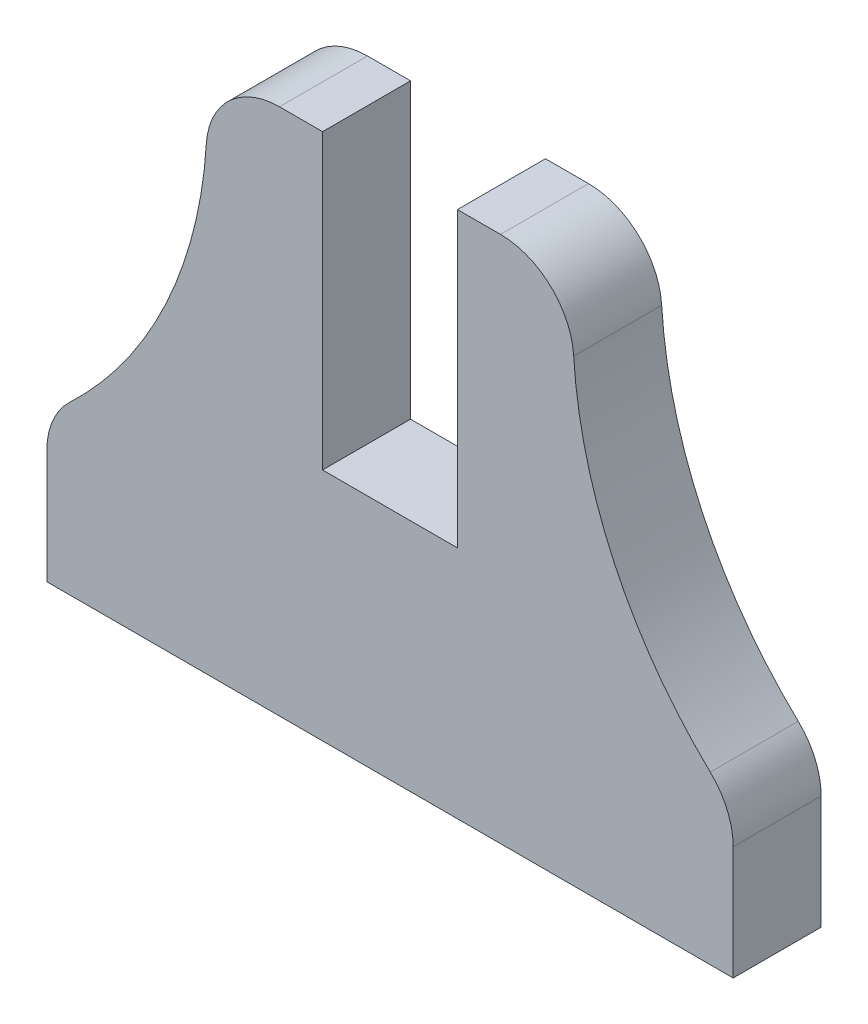
ISO-10303-21;
HEADER;
FILE_DESCRIPTION(('STEP AP214'),'2;1');
FILE_NAME('part.step','',(''),(''),'','','');
FILE_SCHEMA(('AUTOMOTIVE_DESIGN { 1 0 10303 214 1 1 1 1 }'));
ENDSEC;
DATA;
#1=APPLICATION_CONTEXT('core data for automotive mechanical design processes');
#2=APPLICATION_PROTOCOL_DEFINITION('international standard','automotive_design',2000,#1);
#3=PRODUCT_CONTEXT('',#1,'mechanical');
#4=PRODUCT('Part','Part','',(#3));
#5=PRODUCT_RELATED_PRODUCT_CATEGORY('part','',(#4));
#6=PRODUCT_DEFINITION_FORMATION('','',#4);
#7=PRODUCT_DEFINITION_CONTEXT('part definition',#1,'design');
#8=PRODUCT_DEFINITION('design','',#6,#7);
#9=PRODUCT_DEFINITION_SHAPE('','',#8);
#10=(LENGTH_UNIT() NAMED_UNIT(*) SI_UNIT(.MILLI.,.METRE.));
#11=(NAMED_UNIT(*) PLANE_ANGLE_UNIT() SI_UNIT($,.RADIAN.));
#12=(NAMED_UNIT(*) SI_UNIT($,.STERADIAN.) SOLID_ANGLE_UNIT());
#13=UNCERTAINTY_MEASURE_WITH_UNIT(LENGTH_MEASURE(1.E-05),#10,'distance_accuracy_value','');
#14=(GEOMETRIC_REPRESENTATION_CONTEXT(3) GLOBAL_UNCERTAINTY_ASSIGNED_CONTEXT((#13)) GLOBAL_UNIT_ASSIGNED_CONTEXT((#10,
#11,#12)) REPRESENTATION_CONTEXT('',''));
#15=CARTESIAN_POINT('',(0.,0.,0.));
#16=DIRECTION('',(0.,0.,1.));
#17=DIRECTION('',(1.,0.,0.));
#18=AXIS2_PLACEMENT_3D('',#15,#16,#17);
#19=CARTESIAN_POINT('',(-4.29999999999996,-163.694308417855,3.));
#20=DIRECTION('',(0.,-1.,0.));
#21=DIRECTION('',(0.,0.,-1.));
#22=AXIS2_PLACEMENT_3D('',#19,#20,#21);
#23=PLANE('',#22);
#24=DIRECTION('',(-1.,0.,0.));
#25=VECTOR('',#24,1.);
#26=CARTESIAN_POINT('',(-4.29999999999996,-163.694308417855,0.));
#27=LINE('',#26,#25);
#28=CARTESIAN_POINT('',(-4.29999999999996,-163.694308417855,0.));
#29=VERTEX_POINT('',#28);
#30=CARTESIAN_POINT('',(-5.76765251221645,-163.694308417855,0.));
#31=VERTEX_POINT('',#30);
#32=EDGE_CURVE('E176',#29,#31,#27,.T.);
#33=ORIENTED_EDGE('',*,*,#32,.T.);
#34=DIRECTION('',(0.,0.,-1.));
#35=VECTOR('',#34,1.);
#36=CARTESIAN_POINT('',(-5.76765251221645,-163.694308417855,3.));
#37=LINE('',#36,#35);
#38=CARTESIAN_POINT('',(-5.76765251221645,-163.694308417855,3.));
#39=VERTEX_POINT('',#38);
#40=EDGE_CURVE('E11',#39,#31,#37,.T.);
#41=ORIENTED_EDGE('',*,*,#40,.F.);
#42=DIRECTION('',(-1.,0.,0.));
#43=VECTOR('',#42,1.);
#44=CARTESIAN_POINT('',(-4.29999999999996,-163.694308417855,3.));
#45=LINE('',#44,#43);
#46=CARTESIAN_POINT('',(-4.29999999999996,-163.694308417855,3.));
#47=VERTEX_POINT('',#46);
#48=EDGE_CURVE('E217',#47,#39,#45,.T.);
#49=ORIENTED_EDGE('',*,*,#48,.F.);
#50=DIRECTION('',(0.,0.,-1.));
#51=VECTOR('',#50,1.);
#52=CARTESIAN_POINT('',(-4.29999999999996,-163.694308417855,3.));
#53=LINE('',#52,#51);
#54=EDGE_CURVE('E172',#47,#29,#53,.T.);
#55=ORIENTED_EDGE('',*,*,#54,.T.);
#56=EDGE_LOOP('',(#33,#41,#49,#55));
#57=FACE_BOUND('',#56,.T.);
#58=ADVANCED_FACE('F39',(#57),#23,.F.);
#59=CARTESIAN_POINT('',(-5.76765251221645,-166.194308417855,3.));
#60=DIRECTION('',(0.,0.,-1.));
#61=DIRECTION('',(-1.,0.,0.));
#62=AXIS2_PLACEMENT_3D('',#59,#60,#61);
#63=CYLINDRICAL_SURFACE('',#62,2.49999999999999);
#64=CARTESIAN_POINT('',(-5.76765251221645,-166.194308417855,0.));
#65=DIRECTION('',(0.,0.,1.));
#66=DIRECTION('',(1.,0.,0.));
#67=AXIS2_PLACEMENT_3D('',#64,#65,#66);
#68=CIRCLE('',#67,2.49999999999999);
#69=CARTESIAN_POINT('',(-8.26279324575419,-166.038511370898,0.));
#70=VERTEX_POINT('',#69);
#71=EDGE_CURVE('E180',#31,#70,#68,.T.);
#72=ORIENTED_EDGE('',*,*,#71,.T.);
#73=DIRECTION('',(0.,0.,-1.));
#74=VECTOR('',#73,1.);
#75=CARTESIAN_POINT('',(-8.26279324575419,-166.038511370898,3.));
#76=LINE('',#75,#74);
#77=CARTESIAN_POINT('',(-8.26279324575419,-166.038511370898,3.));
#78=VERTEX_POINT('',#77);
#79=EDGE_CURVE('E48',#78,#70,#76,.T.);
#80=ORIENTED_EDGE('',*,*,#79,.F.);
#81=CARTESIAN_POINT('',(-5.76765251221645,-166.194308417855,3.));
#82=DIRECTION('',(0.,0.,1.));
#83=DIRECTION('',(1.,0.,0.));
#84=AXIS2_PLACEMENT_3D('',#81,#82,#83);
#85=CIRCLE('',#84,2.49999999999999);
#86=EDGE_CURVE('E117',#39,#78,#85,.T.);
#87=ORIENTED_EDGE('',*,*,#86,.F.);
#88=ORIENTED_EDGE('',*,*,#40,.T.);
#89=EDGE_LOOP('',(#72,#80,#87,#88));
#90=FACE_BOUND('',#89,.T.);
#91=ADVANCED_FACE('F324',(#90),#63,.T.);
#92=CARTESIAN_POINT('',(-23.2336376469807,-165.103729089152,3.));
#93=DIRECTION('',(0.,0.,-1.));
#94=DIRECTION('',(-1.,0.,0.));
#95=AXIS2_PLACEMENT_3D('',#92,#93,#94);
#96=CYLINDRICAL_SURFACE('',#95,15.);
#97=CARTESIAN_POINT('',(-23.2336376469807,-165.103729089152,0.));
#98=DIRECTION('',(0.,0.,-1.));
#99=DIRECTION('',(-1.,0.,0.));
#100=AXIS2_PLACEMENT_3D('',#97,#98,#99);
#101=CIRCLE('',#100,15.);
#102=CARTESIAN_POINT('',(-12.9190910924258,-175.994556852638,0.));
#103=VERTEX_POINT('',#102);
#104=EDGE_CURVE('E183',#70,#103,#101,.T.);
#105=ORIENTED_EDGE('',*,*,#104,.T.);
#106=DIRECTION('',(0.,0.,-1.));
#107=VECTOR('',#106,1.);
#108=CARTESIAN_POINT('',(-12.9190910924258,-175.994556852638,3.));
#109=LINE('',#108,#107);
#110=CARTESIAN_POINT('',(-12.9190910924258,-175.994556852638,3.));
#111=VERTEX_POINT('',#110);
#112=EDGE_CURVE('E252',#111,#103,#109,.T.);
#113=ORIENTED_EDGE('',*,*,#112,.F.);
#114=CARTESIAN_POINT('',(-23.2336376469807,-165.103729089152,3.));
#115=DIRECTION('',(0.,0.,-1.));
#116=DIRECTION('',(-1.,0.,0.));
#117=AXIS2_PLACEMENT_3D('',#114,#115,#116);
#118=CIRCLE('',#117,15.);
#119=EDGE_CURVE('E262',#78,#111,#118,.T.);
#120=ORIENTED_EDGE('',*,*,#119,.F.);
#121=ORIENTED_EDGE('',*,*,#79,.T.);
#122=EDGE_LOOP('',(#105,#113,#120,#121));
#123=FACE_BOUND('',#122,.T.);
#124=ADVANCED_FACE('F260',(#123),#96,.F.);
#125=CARTESIAN_POINT('',(-11.1999999999999,-177.809694813219,3.));
#126=DIRECTION('',(0.,0.,-1.));
#127=DIRECTION('',(-1.,0.,0.));
#128=AXIS2_PLACEMENT_3D('',#125,#126,#127);
#129=CYLINDRICAL_SURFACE('',#128,2.49999999999998);
#130=CARTESIAN_POINT('',(-11.1999999999999,-177.809694813219,0.));
#131=DIRECTION('',(0.,0.,1.));
#132=DIRECTION('',(-1.,0.,0.));
#133=AXIS2_PLACEMENT_3D('',#130,#131,#132);
#134=CIRCLE('',#133,2.49999999999998);
#135=CARTESIAN_POINT('',(-13.6999999999999,-177.809694813219,0.));
#136=VERTEX_POINT('',#135);
#137=EDGE_CURVE('E186',#103,#136,#134,.T.);
#138=ORIENTED_EDGE('',*,*,#137,.T.);
#139=DIRECTION('',(0.,0.,-1.));
#140=VECTOR('',#139,1.);
#141=CARTESIAN_POINT('',(-13.6999999999999,-177.809694813219,3.));
#142=LINE('',#141,#140);
#143=CARTESIAN_POINT('',(-13.6999999999999,-177.809694813219,3.));
#144=VERTEX_POINT('',#143);
#145=EDGE_CURVE('E248',#144,#136,#142,.T.);
#146=ORIENTED_EDGE('',*,*,#145,.F.);
#147=CARTESIAN_POINT('',(-11.1999999999999,-177.809694813219,3.));
#148=DIRECTION('',(0.,0.,1.));
#149=DIRECTION('',(-1.,0.,0.));
#150=AXIS2_PLACEMENT_3D('',#147,#148,#149);
#151=CIRCLE('',#150,2.49999999999998);
#152=EDGE_CURVE('E280',#111,#144,#151,.T.);
#153=ORIENTED_EDGE('',*,*,#152,.F.);
#154=ORIENTED_EDGE('',*,*,#112,.T.);
#155=EDGE_LOOP('',(#138,#146,#153,#154));
#156=FACE_BOUND('',#155,.T.);
#157=ADVANCED_FACE('F270',(#156),#129,.T.);
#158=CARTESIAN_POINT('',(-13.6999999999999,-181.684305638533,3.));
#159=DIRECTION('',(1.,0.,0.));
#160=DIRECTION('',(0.,1.,0.));
#161=AXIS2_PLACEMENT_3D('',#158,#159,#160);
#162=PLANE('',#161);
#163=DIRECTION('',(0.,-1.,0.));
#164=VECTOR('',#163,1.);
#165=CARTESIAN_POINT('',(-13.6999999999999,-181.684305638533,0.));
#166=LINE('',#165,#164);
#167=CARTESIAN_POINT('',(-13.6999999999999,-181.684305638533,0.));
#168=VERTEX_POINT('',#167);
#169=EDGE_CURVE('E189',#136,#168,#166,.T.);
#170=ORIENTED_EDGE('',*,*,#169,.T.);
#171=DIRECTION('',(0.,0.,-1.));
#172=VECTOR('',#171,1.);
#173=CARTESIAN_POINT('',(-13.6999999999999,-181.684305638533,3.));
#174=LINE('',#173,#172);
#175=CARTESIAN_POINT('',(-13.6999999999999,-181.684305638533,3.));
#176=VERTEX_POINT('',#175);
#177=EDGE_CURVE('E244',#176,#168,#174,.T.);
#178=ORIENTED_EDGE('',*,*,#177,.F.);
#179=DIRECTION('',(0.,-1.,0.));
#180=VECTOR('',#179,1.);
#181=CARTESIAN_POINT('',(-13.6999999999999,-181.684305638533,3.));
#182=LINE('',#181,#180);
#183=EDGE_CURVE('E276',#144,#176,#182,.T.);
#184=ORIENTED_EDGE('',*,*,#183,.F.);
#185=ORIENTED_EDGE('',*,*,#145,.T.);
#186=EDGE_LOOP('',(#170,#178,#184,#185));
#187=FACE_BOUND('',#186,.T.);
#188=ADVANCED_FACE('F274',(#187),#162,.F.);
#189=CARTESIAN_POINT('',(-0.299999999999927,-181.684305638533,3.));
#190=DIRECTION('',(0.,1.,0.));
#191=DIRECTION('',(0.,0.,1.));
#192=AXIS2_PLACEMENT_3D('',#189,#190,#191);
#193=PLANE('',#192);
#194=DIRECTION('',(1.,0.,0.));
#195=VECTOR('',#194,1.);
#196=CARTESIAN_POINT('',(-0.299999999999927,-181.684305638533,0.));
#197=LINE('',#196,#195);
#198=CARTESIAN_POINT('',(9.70000000000007,-181.684305638533,0.));
#199=VERTEX_POINT('',#198);
#200=EDGE_CURVE('E193',#168,#199,#197,.T.);
#201=ORIENTED_EDGE('',*,*,#200,.T.);
#202=DIRECTION('',(0.,0.,-1.));
#203=VECTOR('',#202,1.);
#204=CARTESIAN_POINT('',(9.70000000000007,-181.684305638533,3.));
#205=LINE('',#204,#203);
#206=CARTESIAN_POINT('',(9.70000000000007,-181.684305638533,3.));
#207=VERTEX_POINT('',#206);
#208=EDGE_CURVE('E240',#207,#199,#205,.T.);
#209=ORIENTED_EDGE('',*,*,#208,.F.);
#210=DIRECTION('',(1.,0.,0.));
#211=VECTOR('',#210,1.);
#212=CARTESIAN_POINT('',(-3.69999999999993,-181.684305638533,3.));
#213=LINE('',#212,#211);
#214=EDGE_CURVE('E279',#176,#207,#213,.T.);
#215=ORIENTED_EDGE('',*,*,#214,.F.);
#216=ORIENTED_EDGE('',*,*,#177,.T.);
#217=EDGE_LOOP('',(#201,#209,#215,#216));
#218=FACE_BOUND('',#217,.T.);
#219=ADVANCED_FACE('F337',(#218),#193,.F.);
#220=CARTESIAN_POINT('',(9.70000000000007,-181.684305638533,3.));
#221=DIRECTION('',(-1.,0.,0.));
#222=DIRECTION('',(0.,-1.,0.));
#223=AXIS2_PLACEMENT_3D('',#220,#221,#222);
#224=PLANE('',#223);
#225=DIRECTION('',(0.,1.,0.));
#226=VECTOR('',#225,1.);
#227=CARTESIAN_POINT('',(9.70000000000007,-181.684305638533,0.));
#228=LINE('',#227,#226);
#229=CARTESIAN_POINT('',(9.70000000000006,-177.809694813219,0.));
#230=VERTEX_POINT('',#229);
#231=EDGE_CURVE('E196',#199,#230,#228,.T.);
#232=ORIENTED_EDGE('',*,*,#231,.T.);
#233=DIRECTION('',(0.,0.,-1.));
#234=VECTOR('',#233,1.);
#235=CARTESIAN_POINT('',(9.70000000000006,-177.809694813219,3.));
#236=LINE('',#235,#234);
#237=CARTESIAN_POINT('',(9.70000000000006,-177.809694813219,3.));
#238=VERTEX_POINT('',#237);
#239=EDGE_CURVE('E236',#238,#230,#236,.T.);
#240=ORIENTED_EDGE('',*,*,#239,.F.);
#241=DIRECTION('',(0.,1.,0.));
#242=VECTOR('',#241,1.);
#243=CARTESIAN_POINT('',(9.70000000000007,-181.684305638533,3.));
#244=LINE('',#243,#242);
#245=EDGE_CURVE('E284',#207,#238,#244,.T.);
#246=ORIENTED_EDGE('',*,*,#245,.F.);
#247=ORIENTED_EDGE('',*,*,#208,.T.);
#248=EDGE_LOOP('',(#232,#240,#246,#247));
#249=FACE_BOUND('',#248,.T.);
#250=ADVANCED_FACE('F340',(#249),#224,.F.);
#251=CARTESIAN_POINT('',(7.20000000000007,-177.809694813219,3.));
#252=DIRECTION('',(0.,0.,-1.));
#253=DIRECTION('',(-1.,0.,0.));
#254=AXIS2_PLACEMENT_3D('',#251,#252,#253);
#255=CYLINDRICAL_SURFACE('',#254,2.49999999999998);
#256=CARTESIAN_POINT('',(7.20000000000007,-177.809694813219,0.));
#257=DIRECTION('',(0.,0.,1.));
#258=DIRECTION('',(1.,0.,0.));
#259=AXIS2_PLACEMENT_3D('',#256,#257,#258);
#260=CIRCLE('',#259,2.49999999999998);
#261=CARTESIAN_POINT('',(8.9190910924259,-175.994556852638,0.));
#262=VERTEX_POINT('',#261);
#263=EDGE_CURVE('E199',#230,#262,#260,.T.);
#264=ORIENTED_EDGE('',*,*,#263,.T.);
#265=DIRECTION('',(0.,0.,-1.));
#266=VECTOR('',#265,1.);
#267=CARTESIAN_POINT('',(8.9190910924259,-175.994556852638,3.));
#268=LINE('',#267,#266);
#269=CARTESIAN_POINT('',(8.9190910924259,-175.994556852638,3.));
#270=VERTEX_POINT('',#269);
#271=EDGE_CURVE('E232',#270,#262,#268,.T.);
#272=ORIENTED_EDGE('',*,*,#271,.F.);
#273=CARTESIAN_POINT('',(7.20000000000007,-177.809694813219,3.));
#274=DIRECTION('',(0.,0.,1.));
#275=DIRECTION('',(1.,0.,0.));
#276=AXIS2_PLACEMENT_3D('',#273,#274,#275);
#277=CIRCLE('',#276,2.49999999999998);
#278=EDGE_CURVE('E291',#238,#270,#277,.T.);
#279=ORIENTED_EDGE('',*,*,#278,.F.);
#280=ORIENTED_EDGE('',*,*,#239,.T.);
#281=EDGE_LOOP('',(#264,#272,#279,#280));
#282=FACE_BOUND('',#281,.T.);
#283=ADVANCED_FACE('F344',(#282),#255,.T.);
#284=CARTESIAN_POINT('',(19.2336376469808,-165.103729089152,3.));
#285=DIRECTION('',(0.,0.,-1.));
#286=DIRECTION('',(-1.,0.,0.));
#287=AXIS2_PLACEMENT_3D('',#284,#285,#286);
#288=CYLINDRICAL_SURFACE('',#287,15.);
#289=CARTESIAN_POINT('',(19.2336376469808,-165.103729089152,0.));
#290=DIRECTION('',(0.,0.,-1.));
#291=DIRECTION('',(1.,0.,0.));
#292=AXIS2_PLACEMENT_3D('',#289,#290,#291);
#293=CIRCLE('',#292,15.);
#294=CARTESIAN_POINT('',(4.26279324575434,-166.038511370898,0.));
#295=VERTEX_POINT('',#294);
#296=EDGE_CURVE('E202',#262,#295,#293,.T.);
#297=ORIENTED_EDGE('',*,*,#296,.T.);
#298=DIRECTION('',(0.,0.,-1.));
#299=VECTOR('',#298,1.);
#300=CARTESIAN_POINT('',(4.26279324575434,-166.038511370898,3.));
#301=LINE('',#300,#299);
#302=CARTESIAN_POINT('',(4.26279324575434,-166.038511370898,3.));
#303=VERTEX_POINT('',#302);
#304=EDGE_CURVE('E228',#303,#295,#301,.T.);
#305=ORIENTED_EDGE('',*,*,#304,.F.);
#306=CARTESIAN_POINT('',(19.2336376469808,-165.103729089152,3.));
#307=DIRECTION('',(0.,0.,-1.));
#308=DIRECTION('',(1.,0.,0.));
#309=AXIS2_PLACEMENT_3D('',#306,#307,#308);
#310=CIRCLE('',#309,15.);
#311=EDGE_CURVE('E294',#270,#303,#310,.T.);
#312=ORIENTED_EDGE('',*,*,#311,.F.);
#313=ORIENTED_EDGE('',*,*,#271,.T.);
#314=EDGE_LOOP('',(#297,#305,#312,#313));
#315=FACE_BOUND('',#314,.T.);
#316=ADVANCED_FACE('F348',(#315),#288,.F.);
#317=CARTESIAN_POINT('',(1.7676525122166,-166.194308417855,3.));
#318=DIRECTION('',(0.,0.,-1.));
#319=DIRECTION('',(-1.,0.,0.));
#320=AXIS2_PLACEMENT_3D('',#317,#318,#319);
#321=CYLINDRICAL_SURFACE('',#320,2.49999999999999);
#322=CARTESIAN_POINT('',(1.7676525122166,-166.194308417855,0.));
#323=DIRECTION('',(0.,0.,1.));
#324=DIRECTION('',(-1.,0.,0.));
#325=AXIS2_PLACEMENT_3D('',#322,#323,#324);
#326=CIRCLE('',#325,2.49999999999999);
#327=CARTESIAN_POINT('',(1.7676525122166,-163.694308417855,0.));
#328=VERTEX_POINT('',#327);
#329=EDGE_CURVE('E205',#295,#328,#326,.T.);
#330=ORIENTED_EDGE('',*,*,#329,.T.);
#331=DIRECTION('',(0.,0.,-1.));
#332=VECTOR('',#331,1.);
#333=CARTESIAN_POINT('',(1.7676525122166,-163.694308417855,3.));
#334=LINE('',#333,#332);
#335=CARTESIAN_POINT('',(1.7676525122166,-163.694308417855,3.));
#336=VERTEX_POINT('',#335);
#337=EDGE_CURVE('E224',#336,#328,#334,.T.);
#338=ORIENTED_EDGE('',*,*,#337,.F.);
#339=CARTESIAN_POINT('',(1.7676525122166,-166.194308417855,3.));
#340=DIRECTION('',(0.,0.,1.));
#341=DIRECTION('',(-1.,0.,0.));
#342=AXIS2_PLACEMENT_3D('',#339,#340,#341);
#343=CIRCLE('',#342,2.49999999999999);
#344=EDGE_CURVE('E297',#303,#336,#343,.T.);
#345=ORIENTED_EDGE('',*,*,#344,.F.);
#346=ORIENTED_EDGE('',*,*,#304,.T.);
#347=EDGE_LOOP('',(#330,#338,#345,#346));
#348=FACE_BOUND('',#347,.T.);
#349=ADVANCED_FACE('F305',(#348),#321,.T.);
#350=CARTESIAN_POINT('',(0.300000000000104,-163.694308417855,3.));
#351=DIRECTION('',(0.,-1.,0.));
#352=DIRECTION('',(0.,0.,-1.));
#353=AXIS2_PLACEMENT_3D('',#350,#351,#352);
#354=PLANE('',#353);
#355=DIRECTION('',(-1.,0.,0.));
#356=VECTOR('',#355,1.);
#357=CARTESIAN_POINT('',(0.300000000000104,-163.694308417855,0.));
#358=LINE('',#357,#356);
#359=CARTESIAN_POINT('',(0.300000000000104,-163.694308417855,0.));
#360=VERTEX_POINT('',#359);
#361=EDGE_CURVE('E208',#328,#360,#358,.T.);
#362=ORIENTED_EDGE('',*,*,#361,.T.);
#363=DIRECTION('',(0.,0.,-1.));
#364=VECTOR('',#363,1.);
#365=CARTESIAN_POINT('',(0.300000000000104,-163.694308417855,3.));
#366=LINE('',#365,#364);
#367=CARTESIAN_POINT('',(0.300000000000104,-163.694308417855,3.));
#368=VERTEX_POINT('',#367);
#369=EDGE_CURVE('E165',#368,#360,#366,.T.);
#370=ORIENTED_EDGE('',*,*,#369,.F.);
#371=DIRECTION('',(-1.,0.,0.));
#372=VECTOR('',#371,1.);
#373=CARTESIAN_POINT('',(0.300000000000104,-163.694308417855,3.));
#374=LINE('',#373,#372);
#375=EDGE_CURVE('E154',#336,#368,#374,.T.);
#376=ORIENTED_EDGE('',*,*,#375,.F.);
#377=ORIENTED_EDGE('',*,*,#337,.T.);
#378=EDGE_LOOP('',(#362,#370,#376,#377));
#379=FACE_BOUND('',#378,.T.);
#380=ADVANCED_FACE('F309',(#379),#354,.F.);
#381=CARTESIAN_POINT('',(0.300000000000104,-163.694308417855,3.));
#382=DIRECTION('',(1.,0.,0.));
#383=DIRECTION('',(0.,1.,0.));
#384=AXIS2_PLACEMENT_3D('',#381,#382,#383);
#385=PLANE('',#384);
#386=DIRECTION('',(0.,-1.,0.));
#387=VECTOR('',#386,1.);
#388=CARTESIAN_POINT('',(0.300000000000104,-163.694308417855,0.));
#389=LINE('',#388,#387);
#390=CARTESIAN_POINT('',(0.300000000000105,-173.684305638533,0.));
#391=VERTEX_POINT('',#390);
#392=EDGE_CURVE('E163',#360,#391,#389,.T.);
#393=ORIENTED_EDGE('',*,*,#392,.T.);
#394=DIRECTION('',(0.,0.,-1.));
#395=VECTOR('',#394,1.);
#396=CARTESIAN_POINT('',(0.300000000000105,-173.684305638533,3.));
#397=LINE('',#396,#395);
#398=CARTESIAN_POINT('',(0.300000000000105,-173.684305638533,3.));
#399=VERTEX_POINT('',#398);
#400=EDGE_CURVE('E160',#399,#391,#397,.T.);
#401=ORIENTED_EDGE('',*,*,#400,.F.);
#402=DIRECTION('',(0.,-1.,0.));
#403=VECTOR('',#402,1.);
#404=CARTESIAN_POINT('',(0.300000000000104,-163.694308417855,3.));
#405=LINE('',#404,#403);
#406=EDGE_CURVE('E148',#368,#399,#405,.T.);
#407=ORIENTED_EDGE('',*,*,#406,.F.);
#408=ORIENTED_EDGE('',*,*,#369,.T.);
#409=EDGE_LOOP('',(#393,#401,#407,#408));
#410=FACE_BOUND('',#409,.T.);
#411=ADVANCED_FACE('F161',(#410),#385,.F.);
#412=CARTESIAN_POINT('',(-4.29999999999996,-173.684305638533,3.));
#413=DIRECTION('',(0.,-1.,0.));
#414=DIRECTION('',(0.,0.,-1.));
#415=AXIS2_PLACEMENT_3D('',#412,#413,#414);
#416=PLANE('',#415);
#417=DIRECTION('',(-1.,0.,0.));
#418=VECTOR('',#417,1.);
#419=CARTESIAN_POINT('',(-4.29999999999996,-173.684305638533,0.));
#420=LINE('',#419,#418);
#421=CARTESIAN_POINT('',(-4.29999999999996,-173.684305638533,0.));
#422=VERTEX_POINT('',#421);
#423=EDGE_CURVE('E103',#391,#422,#420,.T.);
#424=ORIENTED_EDGE('',*,*,#423,.T.);
#425=DIRECTION('',(0.,0.,-1.));
#426=VECTOR('',#425,1.);
#427=CARTESIAN_POINT('',(-4.29999999999996,-173.684305638533,3.));
#428=LINE('',#427,#426);
#429=CARTESIAN_POINT('',(-4.29999999999996,-173.684305638533,3.));
#430=VERTEX_POINT('',#429);
#431=EDGE_CURVE('E166',#430,#422,#428,.T.);
#432=ORIENTED_EDGE('',*,*,#431,.F.);
#433=DIRECTION('',(-1.,0.,0.));
#434=VECTOR('',#433,1.);
#435=CARTESIAN_POINT('',(-4.29999999999996,-173.684305638533,3.));
#436=LINE('',#435,#434);
#437=EDGE_CURVE('E152',#399,#430,#436,.T.);
#438=ORIENTED_EDGE('',*,*,#437,.F.);
#439=ORIENTED_EDGE('',*,*,#400,.T.);
#440=EDGE_LOOP('',(#424,#432,#438,#439));
#441=FACE_BOUND('',#440,.T.);
#442=ADVANCED_FACE('F168',(#441),#416,.F.);
#443=CARTESIAN_POINT('',(-4.29999999999996,-163.694308417855,3.));
#444=DIRECTION('',(-1.,0.,0.));
#445=DIRECTION('',(0.,0.,1.));
#446=AXIS2_PLACEMENT_3D('',#443,#444,#445);
#447=PLANE('',#446);
#448=DIRECTION('',(0.,1.,0.));
#449=VECTOR('',#448,1.);
#450=CARTESIAN_POINT('',(-4.29999999999996,-163.694308417855,0.));
#451=LINE('',#450,#449);
#452=EDGE_CURVE('E109',#422,#29,#451,.T.);
#453=ORIENTED_EDGE('',*,*,#452,.T.);
#454=ORIENTED_EDGE('',*,*,#54,.F.);
#455=DIRECTION('',(0.,1.,0.));
#456=VECTOR('',#455,1.);
#457=CARTESIAN_POINT('',(-4.29999999999996,-163.694308417855,3.));
#458=LINE('',#457,#456);
#459=EDGE_CURVE('E56',#430,#47,#458,.T.);
#460=ORIENTED_EDGE('',*,*,#459,.F.);
#461=ORIENTED_EDGE('',*,*,#431,.T.);
#462=EDGE_LOOP('',(#453,#454,#460,#461));
#463=FACE_BOUND('',#462,.T.);
#464=ADVANCED_FACE('F313',(#463),#447,.F.);
#465=CARTESIAN_POINT('',(-5.76765251221645,-166.194308417855,3.));
#466=DIRECTION('',(0.,0.,1.));
#467=DIRECTION('',(1.,0.,0.));
#468=AXIS2_PLACEMENT_3D('',#465,#466,#467);
#469=PLANE('',#468);
#470=ORIENTED_EDGE('',*,*,#48,.T.);
#471=ORIENTED_EDGE('',*,*,#86,.T.);
#472=ORIENTED_EDGE('',*,*,#119,.T.);
#473=ORIENTED_EDGE('',*,*,#152,.T.);
#474=ORIENTED_EDGE('',*,*,#183,.T.);
#475=ORIENTED_EDGE('',*,*,#214,.T.);
#476=ORIENTED_EDGE('',*,*,#245,.T.);
#477=ORIENTED_EDGE('',*,*,#278,.T.);
#478=ORIENTED_EDGE('',*,*,#311,.T.);
#479=ORIENTED_EDGE('',*,*,#344,.T.);
#480=ORIENTED_EDGE('',*,*,#375,.T.);
#481=ORIENTED_EDGE('',*,*,#406,.T.);
#482=ORIENTED_EDGE('',*,*,#437,.T.);
#483=ORIENTED_EDGE('',*,*,#459,.T.);
#484=EDGE_LOOP('',(#470,#471,#472,#473,#474,#475,#476,#477,#478,#479,#480,#481,#482,#483));
#485=FACE_BOUND('',#484,.T.);
#486=ADVANCED_FACE('F150',(#485),#469,.T.);
#487=CARTESIAN_POINT('',(-5.76765251221645,-166.194308417855,0.));
#488=DIRECTION('',(0.,0.,1.));
#489=DIRECTION('',(1.,0.,0.));
#490=AXIS2_PLACEMENT_3D('',#487,#488,#489);
#491=PLANE('',#490);
#492=ORIENTED_EDGE('',*,*,#32,.F.);
#493=ORIENTED_EDGE('',*,*,#452,.F.);
#494=ORIENTED_EDGE('',*,*,#423,.F.);
#495=ORIENTED_EDGE('',*,*,#392,.F.);
#496=ORIENTED_EDGE('',*,*,#361,.F.);
#497=ORIENTED_EDGE('',*,*,#329,.F.);
#498=ORIENTED_EDGE('',*,*,#296,.F.);
#499=ORIENTED_EDGE('',*,*,#263,.F.);
#500=ORIENTED_EDGE('',*,*,#231,.F.);
#501=ORIENTED_EDGE('',*,*,#200,.F.);
#502=ORIENTED_EDGE('',*,*,#169,.F.);
#503=ORIENTED_EDGE('',*,*,#137,.F.);
#504=ORIENTED_EDGE('',*,*,#104,.F.);
#505=ORIENTED_EDGE('',*,*,#71,.F.);
#506=EDGE_LOOP('',(#492,#493,#494,#495,#496,#497,#498,#499,#500,#501,#502,#503,#504,#505));
#507=FACE_BOUND('',#506,.T.);
#508=ADVANCED_FACE('F266',(#507),#491,.F.);
#509=CLOSED_SHELL('',(#58,#91,#124,#157,#188,#219,#250,#283,#316,#349,#380,#411,#442,#464,#486,#508));
#510=MANIFOLD_SOLID_BREP('B2',#509);
#511=ADVANCED_BREP_SHAPE_REPRESENTATION('',(#18,#510),#14);
#512=SHAPE_DEFINITION_REPRESENTATION(#9,#511);
ENDSEC;
END-ISO-10303-21;
